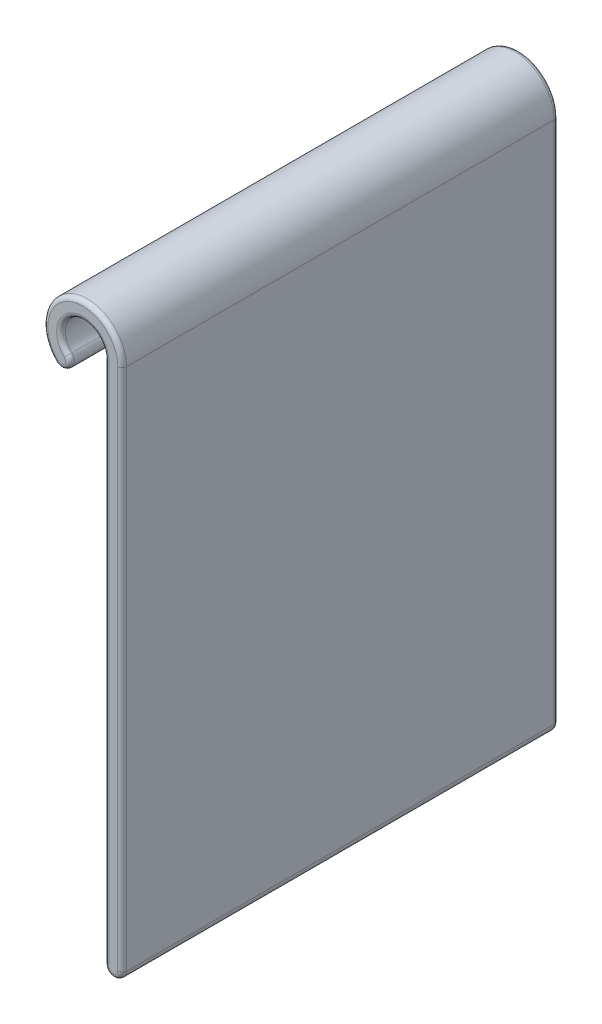
ISO-10303-21;
HEADER;
FILE_DESCRIPTION(('STEP AP214'),'2;1');
FILE_NAME('part.step','',(''),(''),'','','');
FILE_SCHEMA(('AUTOMOTIVE_DESIGN { 1 0 10303 214 1 1 1 1 }'));
ENDSEC;
DATA;
#1=APPLICATION_CONTEXT('core data for automotive mechanical design processes');
#2=APPLICATION_PROTOCOL_DEFINITION('international standard','automotive_design',2000,#1);
#3=PRODUCT_CONTEXT('',#1,'mechanical');
#4=PRODUCT('Part','Part','',(#3));
#5=PRODUCT_RELATED_PRODUCT_CATEGORY('part','',(#4));
#6=PRODUCT_DEFINITION_FORMATION('','',#4);
#7=PRODUCT_DEFINITION_CONTEXT('part definition',#1,'design');
#8=PRODUCT_DEFINITION('design','',#6,#7);
#9=PRODUCT_DEFINITION_SHAPE('','',#8);
#10=(LENGTH_UNIT() NAMED_UNIT(*) SI_UNIT(.MILLI.,.METRE.));
#11=(NAMED_UNIT(*) PLANE_ANGLE_UNIT() SI_UNIT($,.RADIAN.));
#12=(NAMED_UNIT(*) SI_UNIT($,.STERADIAN.) SOLID_ANGLE_UNIT());
#13=UNCERTAINTY_MEASURE_WITH_UNIT(LENGTH_MEASURE(1.E-05),#10,'distance_accuracy_value','');
#14=(GEOMETRIC_REPRESENTATION_CONTEXT(3) GLOBAL_UNCERTAINTY_ASSIGNED_CONTEXT((#13)) GLOBAL_UNIT_ASSIGNED_CONTEXT((#10,
#11,#12)) REPRESENTATION_CONTEXT('',''));
#15=CARTESIAN_POINT('',(0.,0.,0.));
#16=DIRECTION('',(0.,0.,1.));
#17=DIRECTION('',(1.,0.,0.));
#18=AXIS2_PLACEMENT_3D('',#15,#16,#17);
#19=CARTESIAN_POINT('',(4.44500000000001,-76.2,63.5));
#20=DIRECTION('',(0.,0.,-1.));
#21=DIRECTION('',(-1.,0.,0.));
#22=AXIS2_PLACEMENT_3D('',#19,#20,#21);
#23=CYLINDRICAL_SURFACE('',#22,1.27);
#24=DIRECTION('',(0.,0.,-1.));
#25=VECTOR('',#24,1.);
#26=CARTESIAN_POINT('',(3.17500000000001,-76.2,63.5));
#27=LINE('',#26,#25);
#28=CARTESIAN_POINT('',(3.17500000000001,-76.2,62.865));
#29=VERTEX_POINT('',#28);
#30=CARTESIAN_POINT('',(3.17500000000001,-76.2,0.634999999999997));
#31=VERTEX_POINT('',#30);
#32=EDGE_CURVE('E257',#29,#31,#27,.T.);
#33=ORIENTED_EDGE('',*,*,#32,.T.);
#34=CARTESIAN_POINT('',(4.44500000000001,-76.2,0.634999999999997));
#35=DIRECTION('',(0.,0.,1.));
#36=DIRECTION('',(1.,0.,0.));
#37=AXIS2_PLACEMENT_3D('',#34,#35,#36);
#38=CIRCLE('',#37,1.27);
#39=CARTESIAN_POINT('',(5.71500000000001,-76.2,0.634999999999997));
#40=VERTEX_POINT('',#39);
#41=EDGE_CURVE('E220',#31,#40,#38,.T.);
#42=ORIENTED_EDGE('',*,*,#41,.T.);
#43=DIRECTION('',(0.,0.,-1.));
#44=VECTOR('',#43,1.);
#45=CARTESIAN_POINT('',(5.71500000000001,-76.2,63.5));
#46=LINE('',#45,#44);
#47=CARTESIAN_POINT('',(5.71500000000001,-76.2,62.865));
#48=VERTEX_POINT('',#47);
#49=EDGE_CURVE('E156',#48,#40,#46,.T.);
#50=ORIENTED_EDGE('',*,*,#49,.F.);
#51=CARTESIAN_POINT('',(4.44500000000001,-76.2,62.865));
#52=DIRECTION('',(0.,0.,1.));
#53=DIRECTION('',(1.,0.,0.));
#54=AXIS2_PLACEMENT_3D('',#51,#52,#53);
#55=CIRCLE('',#54,1.27);
#56=EDGE_CURVE('E217',#48,#29,#55,.F.);
#57=ORIENTED_EDGE('',*,*,#56,.T.);
#58=EDGE_LOOP('',(#33,#42,#50,#57));
#59=FACE_BOUND('',#58,.T.);
#60=ADVANCED_FACE('F41',(#59),#23,.T.);
#61=CARTESIAN_POINT('',(5.715,0.,63.5));
#62=DIRECTION('',(-1.,0.,0.));
#63=DIRECTION('',(0.,-1.,0.));
#64=AXIS2_PLACEMENT_3D('',#61,#62,#63);
#65=PLANE('',#64);
#66=ORIENTED_EDGE('',*,*,#49,.T.);
#67=DIRECTION('',(0.,1.,0.));
#68=VECTOR('',#67,1.);
#69=CARTESIAN_POINT('',(5.715,0.,0.634999999999997));
#70=LINE('',#69,#68);
#71=CARTESIAN_POINT('',(5.715,0.,0.634999999999997));
#72=VERTEX_POINT('',#71);
#73=EDGE_CURVE('E154',#40,#72,#70,.T.);
#74=ORIENTED_EDGE('',*,*,#73,.T.);
#75=DIRECTION('',(0.,0.,-1.));
#76=VECTOR('',#75,1.);
#77=CARTESIAN_POINT('',(5.715,0.,63.5));
#78=LINE('',#77,#76);
#79=CARTESIAN_POINT('',(5.715,0.,62.865));
#80=VERTEX_POINT('',#79);
#81=EDGE_CURVE('E135',#80,#72,#78,.T.);
#82=ORIENTED_EDGE('',*,*,#81,.F.);
#83=DIRECTION('',(0.,1.,0.));
#84=VECTOR('',#83,1.);
#85=CARTESIAN_POINT('',(5.71500000000001,-76.2,62.865));
#86=LINE('',#85,#84);
#87=EDGE_CURVE('E151',#80,#48,#86,.F.);
#88=ORIENTED_EDGE('',*,*,#87,.T.);
#89=EDGE_LOOP('',(#66,#74,#82,#88));
#90=FACE_BOUND('',#89,.T.);
#91=ADVANCED_FACE('F149',(#90),#65,.F.);
#92=CARTESIAN_POINT('',(0.,0.,63.5));
#93=DIRECTION('',(0.,0.,-1.));
#94=DIRECTION('',(-1.,0.,0.));
#95=AXIS2_PLACEMENT_3D('',#92,#93,#94);
#96=CYLINDRICAL_SURFACE('',#95,5.715);
#97=ORIENTED_EDGE('',*,*,#81,.T.);
#98=CARTESIAN_POINT('',(0.,0.,0.634999999999997));
#99=DIRECTION('',(0.,0.,1.));
#100=DIRECTION('',(1.,0.,0.));
#101=AXIS2_PLACEMENT_3D('',#98,#99,#100);
#102=CIRCLE('',#101,5.715);
#103=CARTESIAN_POINT('',(-4.04111525448111,-4.04111525448112,0.634999999999997));
#104=VERTEX_POINT('',#103);
#105=EDGE_CURVE('E143',#72,#104,#102,.T.);
#106=ORIENTED_EDGE('',*,*,#105,.T.);
#107=DIRECTION('',(0.,0.,-1.));
#108=VECTOR('',#107,1.);
#109=CARTESIAN_POINT('',(-4.04111525448111,-4.04111525448112,63.5));
#110=LINE('',#109,#108);
#111=CARTESIAN_POINT('',(-4.04111525448111,-4.04111525448112,62.865));
#112=VERTEX_POINT('',#111);
#113=EDGE_CURVE('E137',#112,#104,#110,.T.);
#114=ORIENTED_EDGE('',*,*,#113,.F.);
#115=CARTESIAN_POINT('',(0.,0.,62.865));
#116=DIRECTION('',(0.,0.,1.));
#117=DIRECTION('',(1.,0.,0.));
#118=AXIS2_PLACEMENT_3D('',#115,#116,#117);
#119=CIRCLE('',#118,5.715);
#120=EDGE_CURVE('E132',#112,#80,#119,.F.);
#121=ORIENTED_EDGE('',*,*,#120,.T.);
#122=EDGE_LOOP('',(#97,#106,#114,#121));
#123=FACE_BOUND('',#122,.T.);
#124=ADVANCED_FACE('F134',(#123),#96,.T.);
#125=CARTESIAN_POINT('',(-3.1430896423742,-3.14308964237421,63.5));
#126=DIRECTION('',(0.,0.,-1.));
#127=DIRECTION('',(-1.,0.,0.));
#128=AXIS2_PLACEMENT_3D('',#125,#126,#127);
#129=CYLINDRICAL_SURFACE('',#128,1.27);
#130=ORIENTED_EDGE('',*,*,#113,.T.);
#131=CARTESIAN_POINT('',(-3.1430896423742,-3.14308964237421,0.634999999999997));
#132=DIRECTION('',(0.,0.,1.));
#133=DIRECTION('',(1.,0.,0.));
#134=AXIS2_PLACEMENT_3D('',#131,#132,#133);
#135=CIRCLE('',#134,1.27);
#136=CARTESIAN_POINT('',(-2.24506403026728,-2.24506403026729,0.634999999999997));
#137=VERTEX_POINT('',#136);
#138=EDGE_CURVE('E201',#104,#137,#135,.T.);
#139=ORIENTED_EDGE('',*,*,#138,.T.);
#140=DIRECTION('',(0.,0.,-1.));
#141=VECTOR('',#140,1.);
#142=CARTESIAN_POINT('',(-2.24506403026728,-2.24506403026729,63.5));
#143=LINE('',#142,#141);
#144=CARTESIAN_POINT('',(-2.24506403026728,-2.24506403026729,62.865));
#145=VERTEX_POINT('',#144);
#146=EDGE_CURVE('E279',#145,#137,#143,.T.);
#147=ORIENTED_EDGE('',*,*,#146,.F.);
#148=CARTESIAN_POINT('',(-3.1430896423742,-3.14308964237421,62.865));
#149=DIRECTION('',(0.,0.,1.));
#150=DIRECTION('',(1.,0.,0.));
#151=AXIS2_PLACEMENT_3D('',#148,#149,#150);
#152=CIRCLE('',#151,1.27);
#153=EDGE_CURVE('E198',#145,#112,#152,.F.);
#154=ORIENTED_EDGE('',*,*,#153,.T.);
#155=EDGE_LOOP('',(#130,#139,#147,#154));
#156=FACE_BOUND('',#155,.T.);
#157=ADVANCED_FACE('F276',(#156),#129,.T.);
#158=CARTESIAN_POINT('',(0.,0.,63.5));
#159=DIRECTION('',(0.,0.,-1.));
#160=DIRECTION('',(-1.,0.,0.));
#161=AXIS2_PLACEMENT_3D('',#158,#159,#160);
#162=CYLINDRICAL_SURFACE('',#161,3.175);
#163=ORIENTED_EDGE('',*,*,#146,.T.);
#164=CARTESIAN_POINT('',(0.,0.,0.634999999999997));
#165=DIRECTION('',(0.,0.,1.));
#166=DIRECTION('',(1.,0.,0.));
#167=AXIS2_PLACEMENT_3D('',#164,#165,#166);
#168=CIRCLE('',#167,3.175);
#169=CARTESIAN_POINT('',(3.175,0.,0.634999999999997));
#170=VERTEX_POINT('',#169);
#171=EDGE_CURVE('E207',#137,#170,#168,.F.);
#172=ORIENTED_EDGE('',*,*,#171,.T.);
#173=DIRECTION('',(0.,0.,-1.));
#174=VECTOR('',#173,1.);
#175=CARTESIAN_POINT('',(3.175,0.,63.5));
#176=LINE('',#175,#174);
#177=CARTESIAN_POINT('',(3.175,0.,62.865));
#178=VERTEX_POINT('',#177);
#179=EDGE_CURVE('E283',#178,#170,#176,.T.);
#180=ORIENTED_EDGE('',*,*,#179,.F.);
#181=CARTESIAN_POINT('',(0.,0.,62.865));
#182=DIRECTION('',(0.,0.,1.));
#183=DIRECTION('',(1.,0.,0.));
#184=AXIS2_PLACEMENT_3D('',#181,#182,#183);
#185=CIRCLE('',#184,3.175);
#186=EDGE_CURVE('E204',#178,#145,#185,.T.);
#187=ORIENTED_EDGE('',*,*,#186,.T.);
#188=EDGE_LOOP('',(#163,#172,#180,#187));
#189=FACE_BOUND('',#188,.T.);
#190=ADVANCED_FACE('F325',(#189),#162,.F.);
#191=CARTESIAN_POINT('',(3.175,0.,63.5));
#192=DIRECTION('',(1.,0.,0.));
#193=DIRECTION('',(0.,1.,0.));
#194=AXIS2_PLACEMENT_3D('',#191,#192,#193);
#195=PLANE('',#194);
#196=ORIENTED_EDGE('',*,*,#179,.T.);
#197=DIRECTION('',(0.,-1.,0.));
#198=VECTOR('',#197,1.);
#199=CARTESIAN_POINT('',(3.175,0.,0.634999999999997));
#200=LINE('',#199,#198);
#201=EDGE_CURVE('E214',#170,#31,#200,.T.);
#202=ORIENTED_EDGE('',*,*,#201,.T.);
#203=ORIENTED_EDGE('',*,*,#32,.F.);
#204=DIRECTION('',(0.,-1.,0.));
#205=VECTOR('',#204,1.);
#206=CARTESIAN_POINT('',(3.175,0.,62.865));
#207=LINE('',#206,#205);
#208=EDGE_CURVE('E210',#29,#178,#207,.F.);
#209=ORIENTED_EDGE('',*,*,#208,.T.);
#210=EDGE_LOOP('',(#196,#202,#203,#209));
#211=FACE_BOUND('',#210,.T.);
#212=ADVANCED_FACE('F326',(#211),#195,.F.);
#213=CARTESIAN_POINT('',(4.44500000000001,-76.2,63.5));
#214=DIRECTION('',(0.,0.,1.));
#215=DIRECTION('',(1.,0.,0.));
#216=AXIS2_PLACEMENT_3D('',#213,#214,#215);
#217=PLANE('',#216);
#218=CARTESIAN_POINT('',(0.,0.,63.5));
#219=DIRECTION('',(0.,0.,1.));
#220=DIRECTION('',(1.,0.,0.));
#221=AXIS2_PLACEMENT_3D('',#218,#219,#220);
#222=CIRCLE('',#221,3.81);
#223=CARTESIAN_POINT('',(-2.69407683632074,-2.69407683632075,63.5));
#224=VERTEX_POINT('',#223);
#225=CARTESIAN_POINT('',(3.81,0.,63.5));
#226=VERTEX_POINT('',#225);
#227=EDGE_CURVE('E51',#224,#226,#222,.F.);
#228=ORIENTED_EDGE('',*,*,#227,.T.);
#229=DIRECTION('',(0.,-1.,0.));
#230=VECTOR('',#229,1.);
#231=CARTESIAN_POINT('',(3.81000000000001,-76.2,63.5));
#232=LINE('',#231,#230);
#233=CARTESIAN_POINT('',(3.81000000000001,-76.2,63.5));
#234=VERTEX_POINT('',#233);
#235=EDGE_CURVE('E11',#226,#234,#232,.T.);
#236=ORIENTED_EDGE('',*,*,#235,.T.);
#237=CARTESIAN_POINT('',(4.44500000000001,-76.2,63.5));
#238=DIRECTION('',(0.,0.,1.));
#239=DIRECTION('',(1.,0.,0.));
#240=AXIS2_PLACEMENT_3D('',#237,#238,#239);
#241=CIRCLE('',#240,0.635);
#242=CARTESIAN_POINT('',(5.08000000000001,-76.2,63.5));
#243=VERTEX_POINT('',#242);
#244=EDGE_CURVE('E223',#234,#243,#241,.T.);
#245=ORIENTED_EDGE('',*,*,#244,.T.);
#246=DIRECTION('',(0.,1.,0.));
#247=VECTOR('',#246,1.);
#248=CARTESIAN_POINT('',(5.08,0.,63.5));
#249=LINE('',#248,#247);
#250=CARTESIAN_POINT('',(5.08,0.,63.5));
#251=VERTEX_POINT('',#250);
#252=EDGE_CURVE('E226',#243,#251,#249,.T.);
#253=ORIENTED_EDGE('',*,*,#252,.T.);
#254=CARTESIAN_POINT('',(0.,0.,63.5));
#255=DIRECTION('',(0.,0.,1.));
#256=DIRECTION('',(1.,0.,0.));
#257=AXIS2_PLACEMENT_3D('',#254,#255,#256);
#258=CIRCLE('',#257,5.08);
#259=CARTESIAN_POINT('',(-3.59210244842765,-3.59210244842767,63.5));
#260=VERTEX_POINT('',#259);
#261=EDGE_CURVE('E161',#251,#260,#258,.T.);
#262=ORIENTED_EDGE('',*,*,#261,.T.);
#263=CARTESIAN_POINT('',(-3.1430896423742,-3.14308964237421,63.5));
#264=DIRECTION('',(0.,0.,1.));
#265=DIRECTION('',(1.,0.,0.));
#266=AXIS2_PLACEMENT_3D('',#263,#264,#265);
#267=CIRCLE('',#266,0.635);
#268=EDGE_CURVE('E62',#260,#224,#267,.T.);
#269=ORIENTED_EDGE('',*,*,#268,.T.);
#270=EDGE_LOOP('',(#228,#236,#245,#253,#262,#269));
#271=FACE_BOUND('',#270,.T.);
#272=ADVANCED_FACE('F334',(#271),#217,.T.);
#273=CARTESIAN_POINT('',(4.44500000000001,-76.2,0.));
#274=DIRECTION('',(0.,0.,1.));
#275=DIRECTION('',(1.,0.,0.));
#276=AXIS2_PLACEMENT_3D('',#273,#274,#275);
#277=PLANE('',#276);
#278=CARTESIAN_POINT('',(0.,0.,0.));
#279=DIRECTION('',(0.,0.,1.));
#280=DIRECTION('',(1.,0.,0.));
#281=AXIS2_PLACEMENT_3D('',#278,#279,#280);
#282=CIRCLE('',#281,5.08);
#283=CARTESIAN_POINT('',(-3.59210244842766,-3.59210244842767,0.));
#284=VERTEX_POINT('',#283);
#285=CARTESIAN_POINT('',(5.08,0.,0.));
#286=VERTEX_POINT('',#285);
#287=EDGE_CURVE('E190',#284,#286,#282,.F.);
#288=ORIENTED_EDGE('',*,*,#287,.T.);
#289=DIRECTION('',(0.,1.,0.));
#290=VECTOR('',#289,1.);
#291=CARTESIAN_POINT('',(5.08000000000001,-76.2,0.));
#292=LINE('',#291,#290);
#293=CARTESIAN_POINT('',(5.08000000000001,-76.2,0.));
#294=VERTEX_POINT('',#293);
#295=EDGE_CURVE('E144',#286,#294,#292,.F.);
#296=ORIENTED_EDGE('',*,*,#295,.T.);
#297=CARTESIAN_POINT('',(4.44500000000001,-76.2,0.));
#298=DIRECTION('',(0.,0.,1.));
#299=DIRECTION('',(1.,0.,0.));
#300=AXIS2_PLACEMENT_3D('',#297,#298,#299);
#301=CIRCLE('',#300,0.635);
#302=CARTESIAN_POINT('',(3.81000000000001,-76.2,0.));
#303=VERTEX_POINT('',#302);
#304=EDGE_CURVE('E175',#294,#303,#301,.F.);
#305=ORIENTED_EDGE('',*,*,#304,.T.);
#306=DIRECTION('',(0.,-1.,0.));
#307=VECTOR('',#306,1.);
#308=CARTESIAN_POINT('',(3.81000000000001,-76.2,0.));
#309=LINE('',#308,#307);
#310=CARTESIAN_POINT('',(3.81,0.,0.));
#311=VERTEX_POINT('',#310);
#312=EDGE_CURVE('E181',#303,#311,#309,.F.);
#313=ORIENTED_EDGE('',*,*,#312,.T.);
#314=CARTESIAN_POINT('',(0.,0.,0.));
#315=DIRECTION('',(0.,0.,1.));
#316=DIRECTION('',(1.,0.,0.));
#317=AXIS2_PLACEMENT_3D('',#314,#315,#316);
#318=CIRCLE('',#317,3.81);
#319=CARTESIAN_POINT('',(-2.69407683632074,-2.69407683632075,0.));
#320=VERTEX_POINT('',#319);
#321=EDGE_CURVE('E184',#311,#320,#318,.T.);
#322=ORIENTED_EDGE('',*,*,#321,.T.);
#323=CARTESIAN_POINT('',(-3.1430896423742,-3.14308964237421,0.));
#324=DIRECTION('',(0.,0.,1.));
#325=DIRECTION('',(1.,0.,0.));
#326=AXIS2_PLACEMENT_3D('',#323,#324,#325);
#327=CIRCLE('',#326,0.635);
#328=EDGE_CURVE('E187',#320,#284,#327,.F.);
#329=ORIENTED_EDGE('',*,*,#328,.T.);
#330=EDGE_LOOP('',(#288,#296,#305,#313,#322,#329));
#331=FACE_BOUND('',#330,.T.);
#332=ADVANCED_FACE('F336',(#331),#277,.F.);
#333=CARTESIAN_POINT('',(0.,0.,0.634999999999997));
#334=DIRECTION('',(0.,0.,1.));
#335=DIRECTION('',(1.,0.,0.));
#336=AXIS2_PLACEMENT_3D('',#333,#334,#335);
#337=TOROIDAL_SURFACE('',#336,3.81,0.635);
#338=CARTESIAN_POINT('',(-2.69407683632074,-2.69407683632075,0.635));
#339=DIRECTION('',(0.70710678118655,-0.707106781186545,0.));
#340=DIRECTION('',(0.707106781186545,0.70710678118655,0.));
#341=AXIS2_PLACEMENT_3D('',#338,#339,#340);
#342=CIRCLE('',#341,0.635);
#343=EDGE_CURVE('E249',#320,#137,#342,.T.);
#344=ORIENTED_EDGE('',*,*,#343,.F.);
#345=ORIENTED_EDGE('',*,*,#321,.F.);
#346=CARTESIAN_POINT('',(3.81,0.,0.634999999999997));
#347=DIRECTION('',(0.,-1.,0.));
#348=DIRECTION('',(0.,0.,-1.));
#349=AXIS2_PLACEMENT_3D('',#346,#347,#348);
#350=CIRCLE('',#349,0.635);
#351=EDGE_CURVE('E253',#170,#311,#350,.T.);
#352=ORIENTED_EDGE('',*,*,#351,.F.);
#353=ORIENTED_EDGE('',*,*,#171,.F.);
#354=EDGE_LOOP('',(#344,#345,#352,#353));
#355=FACE_BOUND('',#354,.T.);
#356=ADVANCED_FACE('F322',(#355),#337,.T.);
#357=CARTESIAN_POINT('',(3.81,0.,0.634999999999997));
#358=DIRECTION('',(0.,-1.,0.));
#359=DIRECTION('',(1.,0.,0.));
#360=AXIS2_PLACEMENT_3D('',#357,#358,#359);
#361=CYLINDRICAL_SURFACE('',#360,0.635);
#362=ORIENTED_EDGE('',*,*,#351,.T.);
#363=ORIENTED_EDGE('',*,*,#312,.F.);
#364=CARTESIAN_POINT('',(3.81000000000001,-76.2,0.634999999999997));
#365=DIRECTION('',(0.,-1.,0.));
#366=DIRECTION('',(0.,0.,-1.));
#367=AXIS2_PLACEMENT_3D('',#364,#365,#366);
#368=CIRCLE('',#367,0.635);
#369=EDGE_CURVE('E245',#31,#303,#368,.T.);
#370=ORIENTED_EDGE('',*,*,#369,.F.);
#371=ORIENTED_EDGE('',*,*,#201,.F.);
#372=EDGE_LOOP('',(#362,#363,#370,#371));
#373=FACE_BOUND('',#372,.T.);
#374=ADVANCED_FACE('F302',(#373),#361,.T.);
#375=CARTESIAN_POINT('',(-3.1430896423742,-3.14308964237421,0.634999999999997));
#376=DIRECTION('',(0.,0.,1.));
#377=DIRECTION('',(1.,0.,0.));
#378=AXIS2_PLACEMENT_3D('',#375,#376,#377);
#379=DEGENERATE_TOROIDAL_SURFACE('',#378,0.635,0.635,.T.);
#380=ORIENTED_EDGE('',*,*,#343,.T.);
#381=ORIENTED_EDGE('',*,*,#138,.F.);
#382=CARTESIAN_POINT('',(-3.59210244842766,-3.59210244842767,0.635));
#383=DIRECTION('',(-0.707106781186549,0.707106781186546,0.));
#384=DIRECTION('',(-0.707106781186546,-0.707106781186549,0.));
#385=AXIS2_PLACEMENT_3D('',#382,#383,#384);
#386=CIRCLE('',#385,0.635);
#387=EDGE_CURVE('E241',#284,#104,#386,.T.);
#388=ORIENTED_EDGE('',*,*,#387,.F.);
#389=ORIENTED_EDGE('',*,*,#328,.F.);
#390=EDGE_LOOP('',(#380,#381,#388,#389));
#391=FACE_BOUND('',#390,.T.);
#392=ADVANCED_FACE('F318',(#391),#379,.T.);
#393=CARTESIAN_POINT('',(4.44500000000001,-76.2,0.634999999999997));
#394=DIRECTION('',(0.,0.,1.));
#395=DIRECTION('',(1.,0.,0.));
#396=AXIS2_PLACEMENT_3D('',#393,#394,#395);
#397=DEGENERATE_TOROIDAL_SURFACE('',#396,0.635,0.635,.T.);
#398=ORIENTED_EDGE('',*,*,#369,.T.);
#399=ORIENTED_EDGE('',*,*,#304,.F.);
#400=CARTESIAN_POINT('',(5.08000000000001,-76.2,0.634999999999997));
#401=DIRECTION('',(0.,1.,0.));
#402=DIRECTION('',(0.,0.,1.));
#403=AXIS2_PLACEMENT_3D('',#400,#401,#402);
#404=CIRCLE('',#403,0.635);
#405=EDGE_CURVE('E238',#40,#294,#404,.T.);
#406=ORIENTED_EDGE('',*,*,#405,.F.);
#407=ORIENTED_EDGE('',*,*,#41,.F.);
#408=EDGE_LOOP('',(#398,#399,#406,#407));
#409=FACE_BOUND('',#408,.T.);
#410=ADVANCED_FACE('F306',(#409),#397,.T.);
#411=CARTESIAN_POINT('',(0.,0.,0.634999999999997));
#412=DIRECTION('',(0.,0.,1.));
#413=DIRECTION('',(1.,0.,0.));
#414=AXIS2_PLACEMENT_3D('',#411,#412,#413);
#415=TOROIDAL_SURFACE('',#414,5.08,0.635);
#416=ORIENTED_EDGE('',*,*,#387,.T.);
#417=ORIENTED_EDGE('',*,*,#105,.F.);
#418=CARTESIAN_POINT('',(5.08,0.,0.635));
#419=DIRECTION('',(0.,-1.,0.));
#420=DIRECTION('',(1.,0.,0.));
#421=AXIS2_PLACEMENT_3D('',#418,#419,#420);
#422=CIRCLE('',#421,0.635);
#423=EDGE_CURVE('E235',#286,#72,#422,.T.);
#424=ORIENTED_EDGE('',*,*,#423,.F.);
#425=ORIENTED_EDGE('',*,*,#287,.F.);
#426=EDGE_LOOP('',(#416,#417,#424,#425));
#427=FACE_BOUND('',#426,.T.);
#428=ADVANCED_FACE('F314',(#427),#415,.T.);
#429=CARTESIAN_POINT('',(5.08,0.,0.634999999999997));
#430=DIRECTION('',(0.,1.,0.));
#431=DIRECTION('',(-1.,0.,0.));
#432=AXIS2_PLACEMENT_3D('',#429,#430,#431);
#433=CYLINDRICAL_SURFACE('',#432,0.635);
#434=ORIENTED_EDGE('',*,*,#405,.T.);
#435=ORIENTED_EDGE('',*,*,#295,.F.);
#436=ORIENTED_EDGE('',*,*,#423,.T.);
#437=ORIENTED_EDGE('',*,*,#73,.F.);
#438=EDGE_LOOP('',(#434,#435,#436,#437));
#439=FACE_BOUND('',#438,.T.);
#440=ADVANCED_FACE('F309',(#439),#433,.T.);
#441=CARTESIAN_POINT('',(0.,0.,62.865));
#442=DIRECTION('',(0.,0.,1.));
#443=DIRECTION('',(1.,0.,0.));
#444=AXIS2_PLACEMENT_3D('',#441,#442,#443);
#445=TOROIDAL_SURFACE('',#444,5.08,0.635);
#446=CARTESIAN_POINT('',(5.08,0.,62.865));
#447=DIRECTION('',(0.,-1.,0.));
#448=DIRECTION('',(0.,0.,-1.));
#449=AXIS2_PLACEMENT_3D('',#446,#447,#448);
#450=CIRCLE('',#449,0.635);
#451=EDGE_CURVE('E160',#80,#251,#450,.T.);
#452=ORIENTED_EDGE('',*,*,#451,.F.);
#453=ORIENTED_EDGE('',*,*,#120,.F.);
#454=CARTESIAN_POINT('',(-3.59210244842765,-3.59210244842767,62.865));
#455=DIRECTION('',(0.707106781186547,-0.707106781186547,0.));
#456=DIRECTION('',(0.707106781186548,0.707106781186548,0.));
#457=AXIS2_PLACEMENT_3D('',#454,#455,#456);
#458=CIRCLE('',#457,0.635);
#459=EDGE_CURVE('E45',#260,#112,#458,.T.);
#460=ORIENTED_EDGE('',*,*,#459,.F.);
#461=ORIENTED_EDGE('',*,*,#261,.F.);
#462=EDGE_LOOP('',(#452,#453,#460,#461));
#463=FACE_BOUND('',#462,.T.);
#464=ADVANCED_FACE('F43',(#463),#445,.T.);
#465=CARTESIAN_POINT('',(-3.1430896423742,-3.14308964237421,62.865));
#466=DIRECTION('',(0.,0.,1.));
#467=DIRECTION('',(1.,0.,0.));
#468=AXIS2_PLACEMENT_3D('',#465,#466,#467);
#469=DEGENERATE_TOROIDAL_SURFACE('',#468,0.635,0.635,.T.);
#470=ORIENTED_EDGE('',*,*,#459,.T.);
#471=ORIENTED_EDGE('',*,*,#153,.F.);
#472=CARTESIAN_POINT('',(-2.69407683632074,-2.69407683632075,62.865));
#473=DIRECTION('',(-0.707106781186549,0.707106781186547,0.));
#474=DIRECTION('',(-0.707106781186546,-0.707106781186549,0.));
#475=AXIS2_PLACEMENT_3D('',#472,#473,#474);
#476=CIRCLE('',#475,0.635);
#477=EDGE_CURVE('E165',#224,#145,#476,.T.);
#478=ORIENTED_EDGE('',*,*,#477,.F.);
#479=ORIENTED_EDGE('',*,*,#268,.F.);
#480=EDGE_LOOP('',(#470,#471,#478,#479));
#481=FACE_BOUND('',#480,.T.);
#482=ADVANCED_FACE('F273',(#481),#469,.T.);
#483=CARTESIAN_POINT('',(5.08000000000001,-76.2,62.865));
#484=DIRECTION('',(0.,-1.,0.));
#485=DIRECTION('',(1.,0.,0.));
#486=AXIS2_PLACEMENT_3D('',#483,#484,#485);
#487=CYLINDRICAL_SURFACE('',#486,0.635);
#488=ORIENTED_EDGE('',*,*,#451,.T.);
#489=ORIENTED_EDGE('',*,*,#252,.F.);
#490=CARTESIAN_POINT('',(5.08000000000001,-76.2,62.865));
#491=DIRECTION('',(0.,-1.,0.));
#492=DIRECTION('',(0.,0.,-1.));
#493=AXIS2_PLACEMENT_3D('',#490,#491,#492);
#494=CIRCLE('',#493,0.635);
#495=EDGE_CURVE('E169',#48,#243,#494,.T.);
#496=ORIENTED_EDGE('',*,*,#495,.F.);
#497=ORIENTED_EDGE('',*,*,#87,.F.);
#498=EDGE_LOOP('',(#488,#489,#496,#497));
#499=FACE_BOUND('',#498,.T.);
#500=ADVANCED_FACE('F167',(#499),#487,.T.);
#501=CARTESIAN_POINT('',(0.,0.,62.865));
#502=DIRECTION('',(0.,0.,1.));
#503=DIRECTION('',(1.,0.,0.));
#504=AXIS2_PLACEMENT_3D('',#501,#502,#503);
#505=TOROIDAL_SURFACE('',#504,3.81,0.635);
#506=ORIENTED_EDGE('',*,*,#477,.T.);
#507=ORIENTED_EDGE('',*,*,#186,.F.);
#508=CARTESIAN_POINT('',(3.81,0.,62.865));
#509=DIRECTION('',(0.,-1.,0.));
#510=DIRECTION('',(1.,0.,0.));
#511=AXIS2_PLACEMENT_3D('',#508,#509,#510);
#512=CIRCLE('',#511,0.635);
#513=EDGE_CURVE('E261',#226,#178,#512,.T.);
#514=ORIENTED_EDGE('',*,*,#513,.F.);
#515=ORIENTED_EDGE('',*,*,#227,.F.);
#516=EDGE_LOOP('',(#506,#507,#514,#515));
#517=FACE_BOUND('',#516,.T.);
#518=ADVANCED_FACE('F270',(#517),#505,.T.);
#519=CARTESIAN_POINT('',(4.44500000000001,-76.2,62.865));
#520=DIRECTION('',(0.,0.,1.));
#521=DIRECTION('',(1.,0.,0.));
#522=AXIS2_PLACEMENT_3D('',#519,#520,#521);
#523=DEGENERATE_TOROIDAL_SURFACE('',#522,0.635,0.635,.T.);
#524=ORIENTED_EDGE('',*,*,#495,.T.);
#525=ORIENTED_EDGE('',*,*,#244,.F.);
#526=CARTESIAN_POINT('',(3.81000000000001,-76.2,62.865));
#527=DIRECTION('',(0.,1.,0.));
#528=DIRECTION('',(0.,0.,1.));
#529=AXIS2_PLACEMENT_3D('',#526,#527,#528);
#530=CIRCLE('',#529,0.635);
#531=EDGE_CURVE('E258',#29,#234,#530,.T.);
#532=ORIENTED_EDGE('',*,*,#531,.F.);
#533=ORIENTED_EDGE('',*,*,#56,.F.);
#534=EDGE_LOOP('',(#524,#525,#532,#533));
#535=FACE_BOUND('',#534,.T.);
#536=ADVANCED_FACE('F333',(#535),#523,.T.);
#537=CARTESIAN_POINT('',(3.81000000000001,-76.2,62.865));
#538=DIRECTION('',(0.,1.,0.));
#539=DIRECTION('',(-1.,0.,0.));
#540=AXIS2_PLACEMENT_3D('',#537,#538,#539);
#541=CYLINDRICAL_SURFACE('',#540,0.635);
#542=ORIENTED_EDGE('',*,*,#513,.T.);
#543=ORIENTED_EDGE('',*,*,#208,.F.);
#544=ORIENTED_EDGE('',*,*,#531,.T.);
#545=ORIENTED_EDGE('',*,*,#235,.F.);
#546=EDGE_LOOP('',(#542,#543,#544,#545));
#547=FACE_BOUND('',#546,.T.);
#548=ADVANCED_FACE('F329',(#547),#541,.T.);
#549=CLOSED_SHELL('',(#60,#91,#124,#157,#190,#212,#272,#332,#356,#374,#392,#410,#428,#440,#464,
#482,#500,#518,#536,#548));
#550=MANIFOLD_SOLID_BREP('B2',#549);
#551=ADVANCED_BREP_SHAPE_REPRESENTATION('',(#18,#550),#14);
#552=SHAPE_DEFINITION_REPRESENTATION(#9,#551);
ENDSEC;
END-ISO-10303-21;
